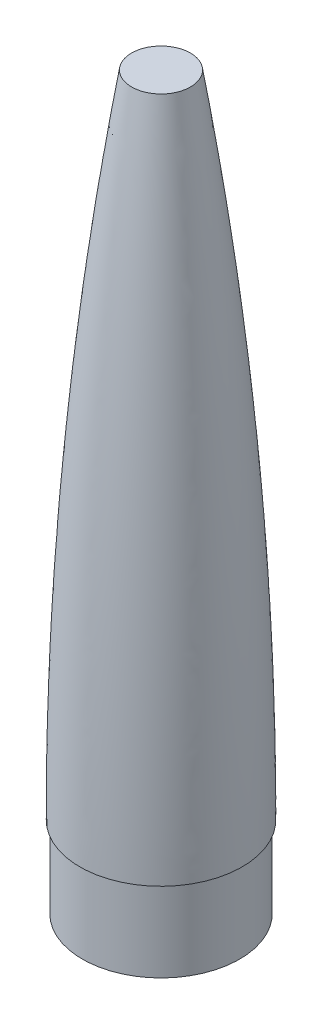
ISO-10303-21;
HEADER;
FILE_DESCRIPTION(('STEP AP214'),'2;1');
FILE_NAME('part.step','',(''),(''),'','','');
FILE_SCHEMA(('AUTOMOTIVE_DESIGN { 1 0 10303 214 1 1 1 1 }'));
ENDSEC;
DATA;
#1=APPLICATION_CONTEXT('core data for automotive mechanical design processes');
#2=APPLICATION_PROTOCOL_DEFINITION('international standard','automotive_design',2000,#1);
#3=PRODUCT_CONTEXT('',#1,'mechanical');
#4=PRODUCT('Part','Part','',(#3));
#5=PRODUCT_RELATED_PRODUCT_CATEGORY('part','',(#4));
#6=PRODUCT_DEFINITION_FORMATION('','',#4);
#7=PRODUCT_DEFINITION_CONTEXT('part definition',#1,'design');
#8=PRODUCT_DEFINITION('design','',#6,#7);
#9=PRODUCT_DEFINITION_SHAPE('','',#8);
#10=(LENGTH_UNIT() NAMED_UNIT(*) SI_UNIT(.MILLI.,.METRE.));
#11=(NAMED_UNIT(*) PLANE_ANGLE_UNIT() SI_UNIT($,.RADIAN.));
#12=(NAMED_UNIT(*) SI_UNIT($,.STERADIAN.) SOLID_ANGLE_UNIT());
#13=UNCERTAINTY_MEASURE_WITH_UNIT(LENGTH_MEASURE(1.E-05),#10,'distance_accuracy_value','');
#14=(GEOMETRIC_REPRESENTATION_CONTEXT(3) GLOBAL_UNCERTAINTY_ASSIGNED_CONTEXT((#13)) GLOBAL_UNIT_ASSIGNED_CONTEXT((#10,
#11,#12)) REPRESENTATION_CONTEXT('',''));
#15=CARTESIAN_POINT('',(0.,0.,0.));
#16=DIRECTION('',(0.,0.,1.));
#17=DIRECTION('',(1.,0.,0.));
#18=AXIS2_PLACEMENT_3D('',#15,#16,#17);
#19=CARTESIAN_POINT('',(1.71600060805526E-11,812.8,0.));
#20=DIRECTION('',(0.,-1.,0.));
#21=DIRECTION('',(0.,0.,-1.));
#22=AXIS2_PLACEMENT_3D('',#19,#20,#21);
#23=PLANE('',#22);
#24=CARTESIAN_POINT('',(0.,812.800000000001,0.));
#25=DIRECTION('',(0.,-1.,0.));
#26=DIRECTION('',(0.,0.,-1.));
#27=AXIS2_PLACEMENT_3D('',#24,#25,#26);
#28=CIRCLE('',#27,36.8107382436538);
#29=CARTESIAN_POINT('',(0.,812.800000000001,-36.8107382436538));
#30=VERTEX_POINT('',#29);
#31=EDGE_CURVE('E10',#30,#30,#28,.T.);
#32=ORIENTED_EDGE('',*,*,#31,.F.);
#33=EDGE_LOOP('',(#32));
#34=FACE_BOUND('',#33,.T.);
#35=ADVANCED_FACE('F39',(#34),#23,.F.);
#36=CARTESIAN_POINT('',(-36.8107382436399,812.800000000088,0.));
#37=CARTESIAN_POINT('',(-36.9942778675381,811.656036287534,0.));
#38=CARTESIAN_POINT('',(-37.3628701438847,809.352341120219,0.));
#39=CARTESIAN_POINT('',(-38.4059770860057,802.812851723432,0.));
#40=CARTESIAN_POINT('',(-39.4063445534059,796.466868939399,0.));
#41=CARTESIAN_POINT('',(-40.5094000899044,789.417479858415,0.));
#42=CARTESIAN_POINT('',(-41.5636705533657,782.608785029749,0.));
#43=CARTESIAN_POINT('',(-42.4113425012624,777.097281594064,0.));
#44=CARTESIAN_POINT('',(-43.2542378182177,771.576058872733,0.));
#45=CARTESIAN_POINT('',(-44.0966419124056,766.017705101634,0.));
#46=CARTESIAN_POINT('',(-44.9372574635269,760.429599919701,0.));
#47=CARTESIAN_POINT('',(-45.7762764460643,754.809835943887,0.));
#48=CARTESIAN_POINT('',(-46.8172442930843,747.784136419474,0.));
#49=CARTESIAN_POINT('',(-48.0539669097659,739.351391314448,0.));
#50=CARTESIAN_POINT('',(-49.4786435972294,729.510576954662,0.));
#51=CARTESIAN_POINT('',(-51.8835815258252,712.635208419306,0.));
#52=CARTESIAN_POINT('',(-56.1784053374686,681.680921395609,0.));
#53=CARTESIAN_POINT('',(-64.3108872319733,619.70971154683,0.));
#54=CARTESIAN_POINT('',(-79.9569813158618,484.234101922189,0.));
#55=CARTESIAN_POINT('',(-91.5619165522518,342.613670709071,0.));
#56=CARTESIAN_POINT('',(-98.2796599898014,206.379377523321,0.));
#57=CARTESIAN_POINT('',(-100.665151632326,101.288631045201,0.));
#58=CARTESIAN_POINT('',(-101.121916521398,71.4617361512993,0.));
#59=CARTESIAN_POINT('',(-101.305723043407,55.1271513591144,0.));
#60=CARTESIAN_POINT('',(-101.362315117216,49.445475511436,0.));
#61=CARTESIAN_POINT('',(-101.40133044313,45.2148835602699,0.));
#62=CARTESIAN_POINT('',(-101.436995751518,41.014909000731,0.));
#63=CARTESIAN_POINT('',(-101.474006364349,36.1352064160095,0.));
#64=CARTESIAN_POINT('',(-101.510147859518,30.5749997133623,0.));
#65=CARTESIAN_POINT('',(-101.540265836947,25.0243241942418,0.));
#66=CARTESIAN_POINT('',(-101.564360261357,19.4325637363225,0.));
#67=CARTESIAN_POINT('',(-101.582431104395,13.9273200626215,0.));
#68=CARTESIAN_POINT('',(-101.594478344888,8.48550626468115,0.));
#69=CARTESIAN_POINT('',(-101.598996062713,3.49324912068522,0.));
#70=CARTESIAN_POINT('',(-101.600000000008,1.15859381780288,0.));
#71=CARTESIAN_POINT('',(-101.600000000008,3.29251402703047E-12,0.));
#72=B_SPLINE_CURVE_WITH_KNOTS('',4,(#36,#37,#38,#39,#40,#41,#42,#43,#44,#45,#46,#47,#48,#49,#50,
#51,#52,#53,#54,#55,#56,#57,#58,#59,#60,#61,#62,#63,#64,#65,#66,#67,#68,#69,#70,#71),
.UNSPECIFIED.,.F.,.F.,(5,1,1,1,1,1,1,1,1,1,1,1,1,1,1,1,1,1,1,1,1,1,1,1,1,1,1,1,1,1,1,1,5),
(0.0833623092059593,0.0890400308531439,0.0947177525003284,0.106073195794698,0.111750917441882,
0.117428639089067,0.123106360736251,0.128784082383436,0.134587047619085,0.140390012854735,
0.146192978090384,0.151995943326034,0.163601873797332,0.175207804268631,0.186813734709129,
0.22163152603062,0.291267108032858,0.430538273603116,0.743898395082925,0.801928047381381,
0.84835176909009,0.859957699551707,0.865760664782516,0.86866214739792,0.871563630013324,
0.87724135137609,0.882919072738856,0.888596794101622,0.894274515464387,0.899952236827153,
0.905629958189919,0.911307679552684,0.91698540091545),.UNSPECIFIED.);
#73=CARTESIAN_POINT('',(0.,0.,0.));
#74=DIRECTION('',(0.,-1.,0.));
#75=AXIS1_PLACEMENT('',#73,#74);
#76=SURFACE_OF_REVOLUTION('',#72,#75);
#77=CARTESIAN_POINT('',(0.,1.33226762955019E-12,0.));
#78=DIRECTION('',(0.,-1.,0.));
#79=DIRECTION('',(0.,0.,-1.));
#80=AXIS2_PLACEMENT_3D('',#77,#78,#79);
#81=CIRCLE('',#80,101.600000000008);
#82=CARTESIAN_POINT('',(0.,1.33226762955019E-12,-101.600000000008));
#83=VERTEX_POINT('',#82);
#84=EDGE_CURVE('E46',#83,#83,#81,.T.);
#85=ORIENTED_EDGE('',*,*,#84,.F.);
#86=EDGE_LOOP('',(#85));
#87=FACE_BOUND('',#86,.T.);
#88=ORIENTED_EDGE('',*,*,#31,.T.);
#89=EDGE_LOOP('',(#88));
#90=FACE_BOUND('',#89,.T.);
#91=ADVANCED_FACE('F73',(#87,#90),#76,.T.);
#92=CARTESIAN_POINT('',(0.,6.66133814775094E-13,0.));
#93=DIRECTION('',(0.,-1.,0.));
#94=DIRECTION('',(0.,0.,-1.));
#95=AXIS2_PLACEMENT_3D('',#92,#93,#94);
#96=PLANE('',#95);
#97=ORIENTED_EDGE('',*,*,#84,.T.);
#98=EDGE_LOOP('',(#97));
#99=FACE_BOUND('',#98,.T.);
#100=CARTESIAN_POINT('',(0.,0.,0.));
#101=DIRECTION('',(0.,-1.,0.));
#102=DIRECTION('',(0.,0.,-1.));
#103=AXIS2_PLACEMENT_3D('',#100,#101,#102);
#104=CIRCLE('',#103,98.4250000000084);
#105=CARTESIAN_POINT('',(0.,0.,-98.4250000000084));
#106=VERTEX_POINT('',#105);
#107=EDGE_CURVE('E51',#106,#106,#104,.T.);
#108=ORIENTED_EDGE('',*,*,#107,.F.);
#109=EDGE_LOOP('',(#108));
#110=FACE_BOUND('',#109,.T.);
#111=ADVANCED_FACE('F78',(#99,#110),#96,.T.);
#112=CARTESIAN_POINT('',(0.,0.,0.));
#113=DIRECTION('',(0.,-1.,0.));
#114=DIRECTION('',(0.,0.,-1.));
#115=AXIS2_PLACEMENT_3D('',#112,#113,#114);
#116=CYLINDRICAL_SURFACE('',#115,98.4250000000083);
#117=CARTESIAN_POINT('',(0.,-101.6,0.));
#118=DIRECTION('',(0.,-1.,0.));
#119=DIRECTION('',(0.,0.,-1.));
#120=AXIS2_PLACEMENT_3D('',#117,#118,#119);
#121=CIRCLE('',#120,98.4250000000083);
#122=CARTESIAN_POINT('',(0.,-101.6,-98.4250000000083));
#123=VERTEX_POINT('',#122);
#124=EDGE_CURVE('E56',#123,#123,#121,.T.);
#125=ORIENTED_EDGE('',*,*,#124,.F.);
#126=EDGE_LOOP('',(#125));
#127=FACE_BOUND('',#126,.T.);
#128=ORIENTED_EDGE('',*,*,#107,.T.);
#129=EDGE_LOOP('',(#128));
#130=FACE_BOUND('',#129,.T.);
#131=ADVANCED_FACE('F94',(#127,#130),#116,.T.);
#132=CARTESIAN_POINT('',(0.,-101.6,0.));
#133=DIRECTION('',(0.,1.,0.));
#134=DIRECTION('',(0.,0.,1.));
#135=AXIS2_PLACEMENT_3D('',#132,#133,#134);
#136=PLANE('',#135);
#137=CARTESIAN_POINT('',(0.,-101.6,0.));
#138=DIRECTION('',(0.,1.,0.));
#139=DIRECTION('',(0.,0.,1.));
#140=AXIS2_PLACEMENT_3D('',#137,#138,#139);
#141=CIRCLE('',#140,95.2500000000083);
#142=CARTESIAN_POINT('',(0.,-101.6,95.2500000000083));
#143=VERTEX_POINT('',#142);
#144=EDGE_CURVE('E67',#143,#143,#141,.F.);
#145=ORIENTED_EDGE('',*,*,#144,.F.);
#146=EDGE_LOOP('',(#145));
#147=FACE_BOUND('',#146,.T.);
#148=ORIENTED_EDGE('',*,*,#124,.T.);
#149=EDGE_LOOP('',(#148));
#150=FACE_BOUND('',#149,.T.);
#151=ADVANCED_FACE('F90',(#147,#150),#136,.F.);
#152=CARTESIAN_POINT('',(1.71600060805526E-11,809.625,0.));
#153=DIRECTION('',(0.,-1.,0.));
#154=DIRECTION('',(0.,0.,-1.));
#155=AXIS2_PLACEMENT_3D('',#152,#153,#154);
#156=PLANE('',#155);
#157=CARTESIAN_POINT('',(0.,809.625,0.));
#158=DIRECTION('',(0.,-1.,0.));
#159=DIRECTION('',(0.,0.,-1.));
#160=AXIS2_PLACEMENT_3D('',#157,#158,#159);
#161=CIRCLE('',#160,34.103598259922);
#162=CARTESIAN_POINT('',(0.,809.625,-34.103598259922));
#163=VERTEX_POINT('',#162);
#164=EDGE_CURVE('E62',#163,#163,#161,.T.);
#165=ORIENTED_EDGE('',*,*,#164,.T.);
#166=EDGE_LOOP('',(#165));
#167=FACE_BOUND('',#166,.T.);
#168=ADVANCED_FACE('F93',(#167),#156,.T.);
#169=CARTESIAN_POINT('',(-36.8107382436399,812.800000000088,0.));
#170=CARTESIAN_POINT('',(-36.9942778675381,811.656036287534,0.));
#171=CARTESIAN_POINT('',(-37.3628701438847,809.352341120219,0.));
#172=CARTESIAN_POINT('',(-38.4059770860057,802.812851723432,0.));
#173=CARTESIAN_POINT('',(-39.4063445534059,796.466868939399,0.));
#174=CARTESIAN_POINT('',(-40.5094000899044,789.417479858415,0.));
#175=CARTESIAN_POINT('',(-41.5636705533657,782.608785029749,0.));
#176=CARTESIAN_POINT('',(-42.4113425012624,777.097281594064,0.));
#177=CARTESIAN_POINT('',(-43.2542378182177,771.576058872733,0.));
#178=CARTESIAN_POINT('',(-44.0966419124056,766.017705101634,0.));
#179=CARTESIAN_POINT('',(-44.9372574635269,760.429599919701,0.));
#180=CARTESIAN_POINT('',(-45.7762764460643,754.809835943887,0.));
#181=CARTESIAN_POINT('',(-46.8172442930843,747.784136419474,0.));
#182=CARTESIAN_POINT('',(-48.0539669097659,739.351391314448,0.));
#183=CARTESIAN_POINT('',(-49.4786435972294,729.510576954662,0.));
#184=CARTESIAN_POINT('',(-51.8835815258252,712.635208419306,0.));
#185=CARTESIAN_POINT('',(-56.1784053374686,681.680921395609,0.));
#186=CARTESIAN_POINT('',(-64.3108872319733,619.70971154683,0.));
#187=CARTESIAN_POINT('',(-79.9569813158618,484.234101922189,0.));
#188=CARTESIAN_POINT('',(-91.5619165522518,342.613670709071,0.));
#189=CARTESIAN_POINT('',(-98.2796599898014,206.379377523321,0.));
#190=CARTESIAN_POINT('',(-100.665151632326,101.288631045201,0.));
#191=CARTESIAN_POINT('',(-101.121916521398,71.4617361512993,0.));
#192=CARTESIAN_POINT('',(-101.305723043407,55.1271513591144,0.));
#193=CARTESIAN_POINT('',(-101.362315117216,49.445475511436,0.));
#194=CARTESIAN_POINT('',(-101.40133044313,45.2148835602699,0.));
#195=CARTESIAN_POINT('',(-101.436995751518,41.014909000731,0.));
#196=CARTESIAN_POINT('',(-101.474006364349,36.1352064160095,0.));
#197=CARTESIAN_POINT('',(-101.510147859518,30.5749997133623,0.));
#198=CARTESIAN_POINT('',(-101.540265836947,25.0243241942418,0.));
#199=CARTESIAN_POINT('',(-101.564360261357,19.4325637363225,0.));
#200=CARTESIAN_POINT('',(-101.582431104395,13.9273200626215,0.));
#201=CARTESIAN_POINT('',(-101.594478344888,8.48550626468115,0.));
#202=CARTESIAN_POINT('',(-101.598996062713,3.49324912068522,0.));
#203=CARTESIAN_POINT('',(-101.600000000008,1.15859381780288,0.));
#204=CARTESIAN_POINT('',(-101.600000000008,3.29251402703047E-12,0.));
#205=B_SPLINE_CURVE_WITH_KNOTS('',4,(#169,#170,#171,#172,#173,#174,#175,#176,#177,#178,#179,
#180,#181,#182,#183,#184,#185,#186,#187,#188,#189,#190,#191,#192,#193,#194,#195,#196,#197,#198,
#199,#200,#201,#202,#203,#204),.UNSPECIFIED.,.F.,.F.,(5,1,1,1,1,1,1,1,1,1,1,1,1,1,1,1,1,1,1,1,1,
1,1,1,1,1,1,1,1,1,1,1,5),(0.0833623092059593,0.0890400308531439,0.0947177525003284,
0.106073195794698,0.111750917441882,0.117428639089067,0.123106360736251,0.128784082383436,
0.134587047619085,0.140390012854735,0.146192978090384,0.151995943326034,0.163601873797332,
0.175207804268631,0.186813734709129,0.22163152603062,0.291267108032858,0.430538273603116,
0.743898395082925,0.801928047381381,0.84835176909009,0.859957699551707,0.865760664782516,
0.86866214739792,0.871563630013324,0.87724135137609,0.882919072738856,0.888596794101622,
0.894274515464387,0.899952236827153,0.905629958189919,0.911307679552684,0.91698540091545),.UNSPECIFIED.);
#206=CARTESIAN_POINT('',(0.,0.,0.));
#207=DIRECTION('',(0.,-1.,0.));
#208=AXIS1_PLACEMENT('',#206,#207);
#209=SURFACE_OF_REVOLUTION('',#205,#208);
#210=OFFSET_SURFACE('',#209,-3.175,.F.);
#211=CARTESIAN_POINT('',(0.,3.17500000000069,0.));
#212=DIRECTION('',(0.,-1.,0.));
#213=DIRECTION('',(0.,0.,-1.));
#214=AXIS2_PLACEMENT_3D('',#211,#212,#213);
#215=CIRCLE('',#214,98.4237614677854);
#216=CARTESIAN_POINT('',(0.,3.17500000000069,-98.4237614677854));
#217=VERTEX_POINT('',#216);
#218=EDGE_CURVE('E155',#217,#217,#215,.T.);
#219=ORIENTED_EDGE('',*,*,#218,.T.);
#220=EDGE_LOOP('',(#219));
#221=FACE_BOUND('',#220,.T.);
#222=ORIENTED_EDGE('',*,*,#164,.F.);
#223=EDGE_LOOP('',(#222));
#224=FACE_BOUND('',#223,.T.);
#225=ADVANCED_FACE('F80',(#221,#224),#210,.F.);
#226=CARTESIAN_POINT('',(0.,3.17500000000067,0.));
#227=DIRECTION('',(0.,-1.,0.));
#228=DIRECTION('',(0.,0.,-1.));
#229=AXIS2_PLACEMENT_3D('',#226,#227,#228);
#230=PLANE('',#229);
#231=ORIENTED_EDGE('',*,*,#218,.F.);
#232=EDGE_LOOP('',(#231));
#233=FACE_BOUND('',#232,.T.);
#234=CARTESIAN_POINT('',(0.,3.17500000000067,0.));
#235=DIRECTION('',(0.,-1.,0.));
#236=DIRECTION('',(0.,0.,-1.));
#237=AXIS2_PLACEMENT_3D('',#234,#235,#236);
#238=CIRCLE('',#237,95.2500000000083);
#239=CARTESIAN_POINT('',(0.,3.17500000000067,-95.2500000000083));
#240=VERTEX_POINT('',#239);
#241=EDGE_CURVE('E161',#240,#240,#238,.T.);
#242=ORIENTED_EDGE('',*,*,#241,.T.);
#243=EDGE_LOOP('',(#242));
#244=FACE_BOUND('',#243,.T.);
#245=ADVANCED_FACE('F82',(#233,#244),#230,.F.);
#246=CARTESIAN_POINT('',(0.,0.,0.));
#247=DIRECTION('',(0.,-1.,0.));
#248=DIRECTION('',(0.,0.,-1.));
#249=AXIS2_PLACEMENT_3D('',#246,#247,#248);
#250=CYLINDRICAL_SURFACE('',#249,95.2500000000083);
#251=ORIENTED_EDGE('',*,*,#144,.T.);
#252=EDGE_LOOP('',(#251));
#253=FACE_BOUND('',#252,.T.);
#254=ORIENTED_EDGE('',*,*,#241,.F.);
#255=EDGE_LOOP('',(#254));
#256=FACE_BOUND('',#255,.T.);
#257=ADVANCED_FACE('F85',(#253,#256),#250,.F.);
#258=CLOSED_SHELL('',(#35,#91,#111,#131,#151,#168,#225,#245,#257));
#259=MANIFOLD_SOLID_BREP('B2',#258);
#260=ADVANCED_BREP_SHAPE_REPRESENTATION('',(#18,#259),#14);
#261=SHAPE_DEFINITION_REPRESENTATION(#9,#260);
ENDSEC;
END-ISO-10303-21;
